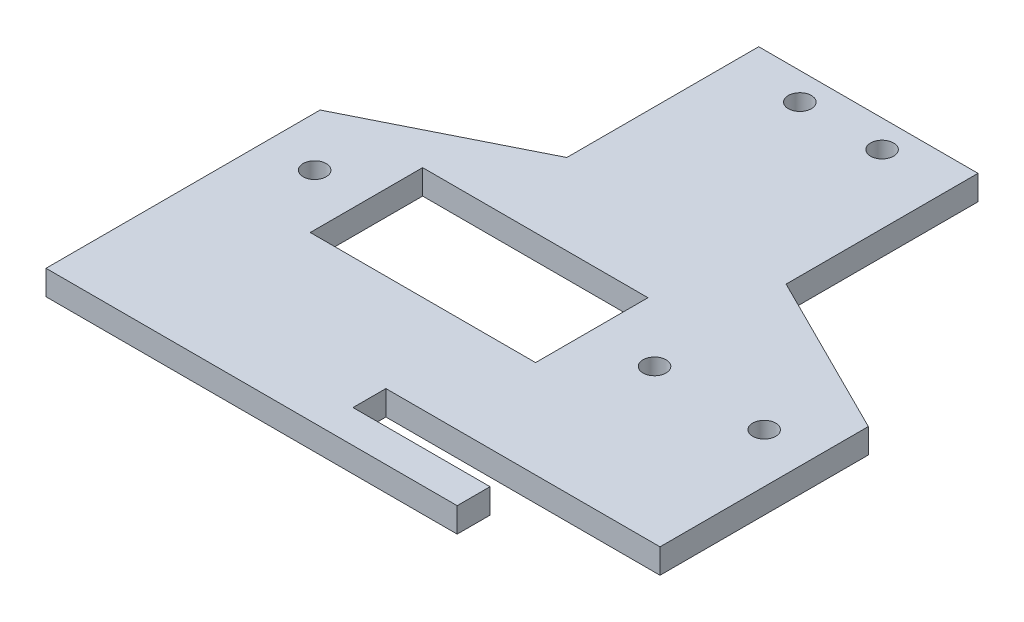
ISO-10303-21;
HEADER;
FILE_DESCRIPTION(('STEP AP214'),'2;1');
FILE_NAME('part.step','',(''),(''),'','','');
FILE_SCHEMA(('AUTOMOTIVE_DESIGN { 1 0 10303 214 1 1 1 1 }'));
ENDSEC;
DATA;
#1=APPLICATION_CONTEXT('core data for automotive mechanical design processes');
#2=APPLICATION_PROTOCOL_DEFINITION('international standard','automotive_design',2000,#1);
#3=PRODUCT_CONTEXT('',#1,'mechanical');
#4=PRODUCT('Part','Part','',(#3));
#5=PRODUCT_RELATED_PRODUCT_CATEGORY('part','',(#4));
#6=PRODUCT_DEFINITION_FORMATION('','',#4);
#7=PRODUCT_DEFINITION_CONTEXT('part definition',#1,'design');
#8=PRODUCT_DEFINITION('design','',#6,#7);
#9=PRODUCT_DEFINITION_SHAPE('','',#8);
#10=(LENGTH_UNIT() NAMED_UNIT(*) SI_UNIT(.MILLI.,.METRE.));
#11=(NAMED_UNIT(*) PLANE_ANGLE_UNIT() SI_UNIT($,.RADIAN.));
#12=(NAMED_UNIT(*) SI_UNIT($,.STERADIAN.) SOLID_ANGLE_UNIT());
#13=UNCERTAINTY_MEASURE_WITH_UNIT(LENGTH_MEASURE(1.E-05),#10,'distance_accuracy_value','');
#14=(GEOMETRIC_REPRESENTATION_CONTEXT(3) GLOBAL_UNCERTAINTY_ASSIGNED_CONTEXT((#13)) GLOBAL_UNIT_ASSIGNED_CONTEXT((#10,
#11,#12)) REPRESENTATION_CONTEXT('',''));
#15=CARTESIAN_POINT('',(0.,0.,0.));
#16=DIRECTION('',(0.,0.,1.));
#17=DIRECTION('',(1.,0.,0.));
#18=AXIS2_PLACEMENT_3D('',#15,#16,#17);
#19=CARTESIAN_POINT('',(0.,4.5,0.));
#20=DIRECTION('',(0.,1.,0.));
#21=DIRECTION('',(0.,0.,1.));
#22=AXIS2_PLACEMENT_3D('',#19,#20,#21);
#23=PLANE('',#22);
#24=CARTESIAN_POINT('',(-7.5,4.5,-70.));
#25=DIRECTION('',(0.,1.,0.));
#26=DIRECTION('',(0.,0.,1.));
#27=AXIS2_PLACEMENT_3D('',#24,#25,#26);
#28=CIRCLE('',#27,2.1);
#29=CARTESIAN_POINT('',(-7.5,4.5,-67.9));
#30=VERTEX_POINT('',#29);
#31=EDGE_CURVE('E293',#30,#30,#28,.T.);
#32=ORIENTED_EDGE('',*,*,#31,.F.);
#33=EDGE_LOOP('',(#32));
#34=FACE_BOUND('',#33,.T.);
#35=CARTESIAN_POINT('',(7.5,4.5,-70.));
#36=DIRECTION('',(0.,1.,0.));
#37=DIRECTION('',(0.,0.,1.));
#38=AXIS2_PLACEMENT_3D('',#35,#36,#37);
#39=CIRCLE('',#38,2.1);
#40=CARTESIAN_POINT('',(7.5,4.5,-67.9));
#41=VERTEX_POINT('',#40);
#42=EDGE_CURVE('E286',#41,#41,#39,.T.);
#43=ORIENTED_EDGE('',*,*,#42,.F.);
#44=EDGE_LOOP('',(#43));
#45=FACE_BOUND('',#44,.T.);
#46=DIRECTION('',(-1.,0.,0.));
#47=VECTOR('',#46,1.);
#48=CARTESIAN_POINT('',(0.,4.5,13.));
#49=LINE('',#48,#47);
#50=CARTESIAN_POINT('',(50.,4.5,13.));
#51=VERTEX_POINT('',#50);
#52=CARTESIAN_POINT('',(0.,4.5,13.));
#53=VERTEX_POINT('',#52);
#54=EDGE_CURVE('E184',#51,#53,#49,.T.);
#55=ORIENTED_EDGE('',*,*,#54,.F.);
#56=DIRECTION('',(0.,0.,-1.));
#57=VECTOR('',#56,1.);
#58=CARTESIAN_POINT('',(50.,4.5,-25.));
#59=LINE('',#58,#57);
#60=CARTESIAN_POINT('',(50.,4.5,-25.));
#61=VERTEX_POINT('',#60);
#62=EDGE_CURVE('E234',#51,#61,#59,.T.);
#63=ORIENTED_EDGE('',*,*,#62,.T.);
#64=DIRECTION('',(-0.894427190999916,0.,-0.447213595499958));
#65=VECTOR('',#64,1.);
#66=CARTESIAN_POINT('',(20.,4.5,-40.));
#67=LINE('',#66,#65);
#68=CARTESIAN_POINT('',(20.,4.5,-40.));
#69=VERTEX_POINT('',#68);
#70=EDGE_CURVE('E236',#61,#69,#67,.T.);
#71=ORIENTED_EDGE('',*,*,#70,.T.);
#72=DIRECTION('',(0.,0.,-1.));
#73=VECTOR('',#72,1.);
#74=CARTESIAN_POINT('',(20.,4.5,-75.));
#75=LINE('',#74,#73);
#76=CARTESIAN_POINT('',(20.,4.5,-75.));
#77=VERTEX_POINT('',#76);
#78=EDGE_CURVE('E239',#69,#77,#75,.T.);
#79=ORIENTED_EDGE('',*,*,#78,.T.);
#80=DIRECTION('',(-1.,0.,0.));
#81=VECTOR('',#80,1.);
#82=CARTESIAN_POINT('',(-20.,4.5,-75.));
#83=LINE('',#82,#81);
#84=CARTESIAN_POINT('',(-20.,4.5,-75.));
#85=VERTEX_POINT('',#84);
#86=EDGE_CURVE('E241',#77,#85,#83,.T.);
#87=ORIENTED_EDGE('',*,*,#86,.T.);
#88=DIRECTION('',(0.,0.,1.));
#89=VECTOR('',#88,1.);
#90=CARTESIAN_POINT('',(-20.,4.5,-40.));
#91=LINE('',#90,#89);
#92=CARTESIAN_POINT('',(-20.,4.5,-40.));
#93=VERTEX_POINT('',#92);
#94=EDGE_CURVE('E243',#85,#93,#91,.T.);
#95=ORIENTED_EDGE('',*,*,#94,.T.);
#96=DIRECTION('',(-0.894427190999916,0.,0.447213595499958));
#97=VECTOR('',#96,1.);
#98=CARTESIAN_POINT('',(-20.,4.5,-40.));
#99=LINE('',#98,#97);
#100=CARTESIAN_POINT('',(-50.,4.5,-25.));
#101=VERTEX_POINT('',#100);
#102=EDGE_CURVE('E245',#93,#101,#99,.T.);
#103=ORIENTED_EDGE('',*,*,#102,.T.);
#104=DIRECTION('',(0.,0.,1.));
#105=VECTOR('',#104,1.);
#106=CARTESIAN_POINT('',(-50.,4.5,-25.));
#107=LINE('',#106,#105);
#108=CARTESIAN_POINT('',(-50.,4.5,25.));
#109=VERTEX_POINT('',#108);
#110=EDGE_CURVE('E247',#101,#109,#107,.T.);
#111=ORIENTED_EDGE('',*,*,#110,.T.);
#112=DIRECTION('',(1.,0.,0.));
#113=VECTOR('',#112,1.);
#114=CARTESIAN_POINT('',(-50.,4.5,25.));
#115=LINE('',#114,#113);
#116=CARTESIAN_POINT('',(25.,4.5,25.));
#117=VERTEX_POINT('',#116);
#118=EDGE_CURVE('E249',#109,#117,#115,.T.);
#119=ORIENTED_EDGE('',*,*,#118,.T.);
#120=DIRECTION('',(0.,0.,1.));
#121=VECTOR('',#120,1.);
#122=CARTESIAN_POINT('',(25.,4.5,0.));
#123=LINE('',#122,#121);
#124=CARTESIAN_POINT('',(25.,4.5,19.));
#125=VERTEX_POINT('',#124);
#126=EDGE_CURVE('E49',#125,#117,#123,.T.);
#127=ORIENTED_EDGE('',*,*,#126,.F.);
#128=DIRECTION('',(1.,0.,0.));
#129=VECTOR('',#128,1.);
#130=CARTESIAN_POINT('',(0.,4.5,19.));
#131=LINE('',#130,#129);
#132=CARTESIAN_POINT('',(0.,4.5,19.));
#133=VERTEX_POINT('',#132);
#134=EDGE_CURVE('E154',#133,#125,#131,.T.);
#135=ORIENTED_EDGE('',*,*,#134,.F.);
#136=DIRECTION('',(0.,0.,1.));
#137=VECTOR('',#136,1.);
#138=CARTESIAN_POINT('',(0.,4.5,0.));
#139=LINE('',#138,#137);
#140=EDGE_CURVE('E187',#53,#133,#139,.T.);
#141=ORIENTED_EDGE('',*,*,#140,.F.);
#142=EDGE_LOOP('',(#55,#63,#71,#79,#87,#95,#103,#111,#119,#127,#135,#141));
#143=FACE_BOUND('',#142,.T.);
#144=DIRECTION('',(0.,0.,1.));
#145=VECTOR('',#144,1.);
#146=CARTESIAN_POINT('',(-31.55,4.5,0.));
#147=LINE('',#146,#145);
#148=CARTESIAN_POINT('',(-31.55,4.5,-25.25));
#149=VERTEX_POINT('',#148);
#150=CARTESIAN_POINT('',(-31.55,4.5,-4.75000000000001));
#151=VERTEX_POINT('',#150);
#152=EDGE_CURVE('E213',#149,#151,#147,.T.);
#153=ORIENTED_EDGE('',*,*,#152,.F.);
#154=DIRECTION('',(-1.,0.,0.));
#155=VECTOR('',#154,1.);
#156=CARTESIAN_POINT('',(0.,4.5,-25.25));
#157=LINE('',#156,#155);
#158=CARTESIAN_POINT('',(9.55000000000006,4.5,-25.25));
#159=VERTEX_POINT('',#158);
#160=EDGE_CURVE('E202',#159,#149,#157,.T.);
#161=ORIENTED_EDGE('',*,*,#160,.F.);
#162=DIRECTION('',(0.,0.,-1.));
#163=VECTOR('',#162,1.);
#164=CARTESIAN_POINT('',(9.55000000000005,4.5,0.));
#165=LINE('',#164,#163);
#166=CARTESIAN_POINT('',(9.55000000000005,4.5,-4.75000000000001));
#167=VERTEX_POINT('',#166);
#168=EDGE_CURVE('E209',#167,#159,#165,.T.);
#169=ORIENTED_EDGE('',*,*,#168,.F.);
#170=DIRECTION('',(1.,0.,0.));
#171=VECTOR('',#170,1.);
#172=CARTESIAN_POINT('',(0.,4.5,-4.75000000000001));
#173=LINE('',#172,#171);
#174=EDGE_CURVE('E211',#151,#167,#173,.T.);
#175=ORIENTED_EDGE('',*,*,#174,.F.);
#176=EDGE_LOOP('',(#153,#161,#169,#175));
#177=FACE_BOUND('',#176,.T.);
#178=CARTESIAN_POINT('',(-41.,4.5,-15.));
#179=DIRECTION('',(0.,1.,0.));
#180=DIRECTION('',(0.,0.,1.));
#181=AXIS2_PLACEMENT_3D('',#178,#179,#180);
#182=CIRCLE('',#181,2.1);
#183=CARTESIAN_POINT('',(-41.,4.5,-12.9));
#184=VERTEX_POINT('',#183);
#185=EDGE_CURVE('E228',#184,#184,#182,.T.);
#186=ORIENTED_EDGE('',*,*,#185,.F.);
#187=EDGE_LOOP('',(#186));
#188=FACE_BOUND('',#187,.T.);
#189=CARTESIAN_POINT('',(41.,4.5,-15.));
#190=DIRECTION('',(0.,1.,0.));
#191=DIRECTION('',(0.,0.,1.));
#192=AXIS2_PLACEMENT_3D('',#189,#190,#191);
#193=CIRCLE('',#192,2.1);
#194=CARTESIAN_POINT('',(41.,4.5,-12.9));
#195=VERTEX_POINT('',#194);
#196=EDGE_CURVE('E222',#195,#195,#193,.T.);
#197=ORIENTED_EDGE('',*,*,#196,.F.);
#198=EDGE_LOOP('',(#197));
#199=FACE_BOUND('',#198,.T.);
#200=CARTESIAN_POINT('',(21.,4.5,-15.));
#201=DIRECTION('',(0.,1.,0.));
#202=DIRECTION('',(0.,0.,1.));
#203=AXIS2_PLACEMENT_3D('',#200,#201,#202);
#204=CIRCLE('',#203,2.1);
#205=CARTESIAN_POINT('',(21.,4.5,-12.9));
#206=VERTEX_POINT('',#205);
#207=EDGE_CURVE('E216',#206,#206,#204,.T.);
#208=ORIENTED_EDGE('',*,*,#207,.F.);
#209=EDGE_LOOP('',(#208));
#210=FACE_BOUND('',#209,.T.);
#211=ADVANCED_FACE('F32',(#34,#45,#143,#177,#188,#199,#210),#23,.T.);
#212=CARTESIAN_POINT('',(0.,0.,0.));
#213=DIRECTION('',(0.,1.,0.));
#214=DIRECTION('',(0.,0.,1.));
#215=AXIS2_PLACEMENT_3D('',#212,#213,#214);
#216=PLANE('',#215);
#217=CARTESIAN_POINT('',(-7.5,0.,-70.));
#218=DIRECTION('',(0.,1.,0.));
#219=DIRECTION('',(0.,0.,1.));
#220=AXIS2_PLACEMENT_3D('',#217,#218,#219);
#221=CIRCLE('',#220,2.1);
#222=CARTESIAN_POINT('',(-7.5,0.,-67.9));
#223=VERTEX_POINT('',#222);
#224=EDGE_CURVE('E36',#223,#223,#221,.T.);
#225=ORIENTED_EDGE('',*,*,#224,.T.);
#226=EDGE_LOOP('',(#225));
#227=FACE_BOUND('',#226,.T.);
#228=CARTESIAN_POINT('',(7.5,0.,-70.));
#229=DIRECTION('',(0.,1.,0.));
#230=DIRECTION('',(0.,0.,1.));
#231=AXIS2_PLACEMENT_3D('',#228,#229,#230);
#232=CIRCLE('',#231,2.1);
#233=CARTESIAN_POINT('',(7.5,0.,-67.9));
#234=VERTEX_POINT('',#233);
#235=EDGE_CURVE('E164',#234,#234,#232,.T.);
#236=ORIENTED_EDGE('',*,*,#235,.T.);
#237=EDGE_LOOP('',(#236));
#238=FACE_BOUND('',#237,.T.);
#239=DIRECTION('',(1.,0.,0.));
#240=VECTOR('',#239,1.);
#241=CARTESIAN_POINT('',(9.55000000000006,0.,-25.25));
#242=LINE('',#241,#240);
#243=CARTESIAN_POINT('',(-31.55,0.,-25.25));
#244=VERTEX_POINT('',#243);
#245=CARTESIAN_POINT('',(9.55000000000006,0.,-25.25));
#246=VERTEX_POINT('',#245);
#247=EDGE_CURVE('E191',#244,#246,#242,.T.);
#248=ORIENTED_EDGE('',*,*,#247,.F.);
#249=DIRECTION('',(0.,0.,-1.));
#250=VECTOR('',#249,1.);
#251=CARTESIAN_POINT('',(-31.55,0.,-25.25));
#252=LINE('',#251,#250);
#253=CARTESIAN_POINT('',(-31.55,0.,-4.75000000000001));
#254=VERTEX_POINT('',#253);
#255=EDGE_CURVE('E189',#254,#244,#252,.T.);
#256=ORIENTED_EDGE('',*,*,#255,.F.);
#257=DIRECTION('',(-1.,0.,0.));
#258=VECTOR('',#257,1.);
#259=CARTESIAN_POINT('',(-31.55,0.,-4.75000000000001));
#260=LINE('',#259,#258);
#261=CARTESIAN_POINT('',(9.55000000000005,0.,-4.75000000000001));
#262=VERTEX_POINT('',#261);
#263=EDGE_CURVE('E196',#262,#254,#260,.T.);
#264=ORIENTED_EDGE('',*,*,#263,.F.);
#265=DIRECTION('',(0.,0.,1.));
#266=VECTOR('',#265,1.);
#267=CARTESIAN_POINT('',(9.55000000000005,0.,-4.75000000000001));
#268=LINE('',#267,#266);
#269=EDGE_CURVE('E193',#246,#262,#268,.T.);
#270=ORIENTED_EDGE('',*,*,#269,.F.);
#271=EDGE_LOOP('',(#248,#256,#264,#270));
#272=FACE_BOUND('',#271,.T.);
#273=CARTESIAN_POINT('',(-41.,0.,-15.));
#274=DIRECTION('',(0.,1.,0.));
#275=DIRECTION('',(0.,0.,1.));
#276=AXIS2_PLACEMENT_3D('',#273,#274,#275);
#277=CIRCLE('',#276,2.1);
#278=CARTESIAN_POINT('',(-41.,0.,-12.9));
#279=VERTEX_POINT('',#278);
#280=EDGE_CURVE('E225',#279,#279,#277,.T.);
#281=ORIENTED_EDGE('',*,*,#280,.T.);
#282=EDGE_LOOP('',(#281));
#283=FACE_BOUND('',#282,.T.);
#284=DIRECTION('',(0.,0.,-1.));
#285=VECTOR('',#284,1.);
#286=CARTESIAN_POINT('',(50.,0.,-25.));
#287=LINE('',#286,#285);
#288=CARTESIAN_POINT('',(50.,0.,13.));
#289=VERTEX_POINT('',#288);
#290=CARTESIAN_POINT('',(50.,0.,-25.));
#291=VERTEX_POINT('',#290);
#292=EDGE_CURVE('E231',#289,#291,#287,.T.);
#293=ORIENTED_EDGE('',*,*,#292,.F.);
#294=DIRECTION('',(1.,0.,0.));
#295=VECTOR('',#294,1.);
#296=CARTESIAN_POINT('',(50.,0.,13.));
#297=LINE('',#296,#295);
#298=CARTESIAN_POINT('',(0.,0.,13.));
#299=VERTEX_POINT('',#298);
#300=EDGE_CURVE('E156',#299,#289,#297,.T.);
#301=ORIENTED_EDGE('',*,*,#300,.F.);
#302=DIRECTION('',(0.,0.,-1.));
#303=VECTOR('',#302,1.);
#304=CARTESIAN_POINT('',(0.,0.,19.));
#305=LINE('',#304,#303);
#306=CARTESIAN_POINT('',(0.,0.,19.));
#307=VERTEX_POINT('',#306);
#308=EDGE_CURVE('E171',#307,#299,#305,.T.);
#309=ORIENTED_EDGE('',*,*,#308,.F.);
#310=DIRECTION('',(-1.,0.,0.));
#311=VECTOR('',#310,1.);
#312=CARTESIAN_POINT('',(0.,0.,19.));
#313=LINE('',#312,#311);
#314=CARTESIAN_POINT('',(25.,0.,19.));
#315=VERTEX_POINT('',#314);
#316=EDGE_CURVE('E151',#315,#307,#313,.T.);
#317=ORIENTED_EDGE('',*,*,#316,.F.);
#318=DIRECTION('',(0.,0.,-1.));
#319=VECTOR('',#318,1.);
#320=CARTESIAN_POINT('',(25.,0.,19.));
#321=LINE('',#320,#319);
#322=CARTESIAN_POINT('',(25.,0.,25.));
#323=VERTEX_POINT('',#322);
#324=EDGE_CURVE('E159',#323,#315,#321,.T.);
#325=ORIENTED_EDGE('',*,*,#324,.F.);
#326=DIRECTION('',(1.,0.,0.));
#327=VECTOR('',#326,1.);
#328=CARTESIAN_POINT('',(-50.,0.,25.));
#329=LINE('',#328,#327);
#330=CARTESIAN_POINT('',(-50.,0.,25.));
#331=VERTEX_POINT('',#330);
#332=EDGE_CURVE('E237',#331,#323,#329,.T.);
#333=ORIENTED_EDGE('',*,*,#332,.F.);
#334=DIRECTION('',(0.,0.,1.));
#335=VECTOR('',#334,1.);
#336=CARTESIAN_POINT('',(-50.,0.,-25.));
#337=LINE('',#336,#335);
#338=CARTESIAN_POINT('',(-50.,0.,-25.));
#339=VERTEX_POINT('',#338);
#340=EDGE_CURVE('E264',#339,#331,#337,.T.);
#341=ORIENTED_EDGE('',*,*,#340,.F.);
#342=DIRECTION('',(-0.894427190999916,0.,0.447213595499958));
#343=VECTOR('',#342,1.);
#344=CARTESIAN_POINT('',(-20.,0.,-40.));
#345=LINE('',#344,#343);
#346=CARTESIAN_POINT('',(-20.,0.,-40.));
#347=VERTEX_POINT('',#346);
#348=EDGE_CURVE('E262',#347,#339,#345,.T.);
#349=ORIENTED_EDGE('',*,*,#348,.F.);
#350=DIRECTION('',(0.,0.,1.));
#351=VECTOR('',#350,1.);
#352=CARTESIAN_POINT('',(-20.,0.,-40.));
#353=LINE('',#352,#351);
#354=CARTESIAN_POINT('',(-20.,0.,-75.));
#355=VERTEX_POINT('',#354);
#356=EDGE_CURVE('E260',#355,#347,#353,.T.);
#357=ORIENTED_EDGE('',*,*,#356,.F.);
#358=DIRECTION('',(-1.,0.,0.));
#359=VECTOR('',#358,1.);
#360=CARTESIAN_POINT('',(-20.,0.,-75.));
#361=LINE('',#360,#359);
#362=CARTESIAN_POINT('',(20.,0.,-75.));
#363=VERTEX_POINT('',#362);
#364=EDGE_CURVE('E258',#363,#355,#361,.T.);
#365=ORIENTED_EDGE('',*,*,#364,.F.);
#366=DIRECTION('',(0.,0.,-1.));
#367=VECTOR('',#366,1.);
#368=CARTESIAN_POINT('',(20.,0.,-75.));
#369=LINE('',#368,#367);
#370=CARTESIAN_POINT('',(20.,0.,-40.));
#371=VERTEX_POINT('',#370);
#372=EDGE_CURVE('E256',#371,#363,#369,.T.);
#373=ORIENTED_EDGE('',*,*,#372,.F.);
#374=DIRECTION('',(-0.894427190999916,0.,-0.447213595499958));
#375=VECTOR('',#374,1.);
#376=CARTESIAN_POINT('',(20.,0.,-40.));
#377=LINE('',#376,#375);
#378=EDGE_CURVE('E254',#291,#371,#377,.T.);
#379=ORIENTED_EDGE('',*,*,#378,.F.);
#380=EDGE_LOOP('',(#293,#301,#309,#317,#325,#333,#341,#349,#357,#365,#373,#379));
#381=FACE_BOUND('',#380,.T.);
#382=CARTESIAN_POINT('',(41.,0.,-15.));
#383=DIRECTION('',(0.,1.,0.));
#384=DIRECTION('',(0.,0.,1.));
#385=AXIS2_PLACEMENT_3D('',#382,#383,#384);
#386=CIRCLE('',#385,2.1);
#387=CARTESIAN_POINT('',(41.,0.,-12.9));
#388=VERTEX_POINT('',#387);
#389=EDGE_CURVE('E219',#388,#388,#386,.T.);
#390=ORIENTED_EDGE('',*,*,#389,.T.);
#391=EDGE_LOOP('',(#390));
#392=FACE_BOUND('',#391,.T.);
#393=CARTESIAN_POINT('',(21.,0.,-15.));
#394=DIRECTION('',(0.,1.,0.));
#395=DIRECTION('',(0.,0.,1.));
#396=AXIS2_PLACEMENT_3D('',#393,#394,#395);
#397=CIRCLE('',#396,2.1);
#398=CARTESIAN_POINT('',(21.,0.,-12.9));
#399=VERTEX_POINT('',#398);
#400=EDGE_CURVE('E215',#399,#399,#397,.T.);
#401=ORIENTED_EDGE('',*,*,#400,.T.);
#402=EDGE_LOOP('',(#401));
#403=FACE_BOUND('',#402,.T.);
#404=ADVANCED_FACE('F167',(#227,#238,#272,#283,#381,#392,#403),#216,.F.);
#405=CARTESIAN_POINT('',(50.,4.5,-25.));
#406=DIRECTION('',(-1.,0.,0.));
#407=DIRECTION('',(0.,0.,1.));
#408=AXIS2_PLACEMENT_3D('',#405,#406,#407);
#409=PLANE('',#408);
#410=ORIENTED_EDGE('',*,*,#62,.F.);
#411=DIRECTION('',(0.,-1.,0.));
#412=VECTOR('',#411,1.);
#413=CARTESIAN_POINT('',(50.,10.,13.));
#414=LINE('',#413,#412);
#415=EDGE_CURVE('E177',#51,#289,#414,.T.);
#416=ORIENTED_EDGE('',*,*,#415,.T.);
#417=ORIENTED_EDGE('',*,*,#292,.T.);
#418=DIRECTION('',(0.,-1.,0.));
#419=VECTOR('',#418,1.);
#420=CARTESIAN_POINT('',(50.,4.5,-25.));
#421=LINE('',#420,#419);
#422=EDGE_CURVE('E41',#61,#291,#421,.T.);
#423=ORIENTED_EDGE('',*,*,#422,.F.);
#424=EDGE_LOOP('',(#410,#416,#417,#423));
#425=FACE_BOUND('',#424,.T.);
#426=ADVANCED_FACE('F34',(#425),#409,.F.);
#427=CARTESIAN_POINT('',(20.,4.5,-40.));
#428=DIRECTION('',(-0.447213595499958,0.,0.894427190999916));
#429=DIRECTION('',(0.894427190999916,0.,0.447213595499958));
#430=AXIS2_PLACEMENT_3D('',#427,#428,#429);
#431=PLANE('',#430);
#432=ORIENTED_EDGE('',*,*,#378,.T.);
#433=DIRECTION('',(0.,-1.,0.));
#434=VECTOR('',#433,1.);
#435=CARTESIAN_POINT('',(20.,4.5,-40.));
#436=LINE('',#435,#434);
#437=EDGE_CURVE('E281',#69,#371,#436,.T.);
#438=ORIENTED_EDGE('',*,*,#437,.F.);
#439=ORIENTED_EDGE('',*,*,#70,.F.);
#440=ORIENTED_EDGE('',*,*,#422,.T.);
#441=EDGE_LOOP('',(#432,#438,#439,#440));
#442=FACE_BOUND('',#441,.T.);
#443=ADVANCED_FACE('F333',(#442),#431,.F.);
#444=CARTESIAN_POINT('',(20.,4.5,-75.));
#445=DIRECTION('',(-1.,0.,0.));
#446=DIRECTION('',(0.,0.,1.));
#447=AXIS2_PLACEMENT_3D('',#444,#445,#446);
#448=PLANE('',#447);
#449=ORIENTED_EDGE('',*,*,#372,.T.);
#450=DIRECTION('',(0.,-1.,0.));
#451=VECTOR('',#450,1.);
#452=CARTESIAN_POINT('',(20.,4.5,-75.));
#453=LINE('',#452,#451);
#454=EDGE_CURVE('E278',#77,#363,#453,.T.);
#455=ORIENTED_EDGE('',*,*,#454,.F.);
#456=ORIENTED_EDGE('',*,*,#78,.F.);
#457=ORIENTED_EDGE('',*,*,#437,.T.);
#458=EDGE_LOOP('',(#449,#455,#456,#457));
#459=FACE_BOUND('',#458,.T.);
#460=ADVANCED_FACE('F357',(#459),#448,.F.);
#461=CARTESIAN_POINT('',(-20.,4.5,-75.));
#462=DIRECTION('',(0.,0.,1.));
#463=DIRECTION('',(1.,0.,0.));
#464=AXIS2_PLACEMENT_3D('',#461,#462,#463);
#465=PLANE('',#464);
#466=ORIENTED_EDGE('',*,*,#364,.T.);
#467=DIRECTION('',(0.,-1.,0.));
#468=VECTOR('',#467,1.);
#469=CARTESIAN_POINT('',(-20.,4.5,-75.));
#470=LINE('',#469,#468);
#471=EDGE_CURVE('E275',#85,#355,#470,.T.);
#472=ORIENTED_EDGE('',*,*,#471,.F.);
#473=ORIENTED_EDGE('',*,*,#86,.F.);
#474=ORIENTED_EDGE('',*,*,#454,.T.);
#475=EDGE_LOOP('',(#466,#472,#473,#474));
#476=FACE_BOUND('',#475,.T.);
#477=ADVANCED_FACE('F353',(#476),#465,.F.);
#478=CARTESIAN_POINT('',(-20.,4.5,-40.));
#479=DIRECTION('',(1.,0.,0.));
#480=DIRECTION('',(0.,0.,-1.));
#481=AXIS2_PLACEMENT_3D('',#478,#479,#480);
#482=PLANE('',#481);
#483=ORIENTED_EDGE('',*,*,#356,.T.);
#484=DIRECTION('',(0.,-1.,0.));
#485=VECTOR('',#484,1.);
#486=CARTESIAN_POINT('',(-20.,4.5,-40.));
#487=LINE('',#486,#485);
#488=EDGE_CURVE('E272',#93,#347,#487,.T.);
#489=ORIENTED_EDGE('',*,*,#488,.F.);
#490=ORIENTED_EDGE('',*,*,#94,.F.);
#491=ORIENTED_EDGE('',*,*,#471,.T.);
#492=EDGE_LOOP('',(#483,#489,#490,#491));
#493=FACE_BOUND('',#492,.T.);
#494=ADVANCED_FACE('F349',(#493),#482,.F.);
#495=CARTESIAN_POINT('',(-20.,4.5,-40.));
#496=DIRECTION('',(0.447213595499958,0.,0.894427190999916));
#497=DIRECTION('',(0.894427190999916,0.,-0.447213595499958));
#498=AXIS2_PLACEMENT_3D('',#495,#496,#497);
#499=PLANE('',#498);
#500=ORIENTED_EDGE('',*,*,#348,.T.);
#501=DIRECTION('',(0.,-1.,0.));
#502=VECTOR('',#501,1.);
#503=CARTESIAN_POINT('',(-50.,4.5,-25.));
#504=LINE('',#503,#502);
#505=EDGE_CURVE('E269',#101,#339,#504,.T.);
#506=ORIENTED_EDGE('',*,*,#505,.F.);
#507=ORIENTED_EDGE('',*,*,#102,.F.);
#508=ORIENTED_EDGE('',*,*,#488,.T.);
#509=EDGE_LOOP('',(#500,#506,#507,#508));
#510=FACE_BOUND('',#509,.T.);
#511=ADVANCED_FACE('F345',(#510),#499,.F.);
#512=CARTESIAN_POINT('',(-50.,4.5,-25.));
#513=DIRECTION('',(1.,0.,0.));
#514=DIRECTION('',(0.,0.,-1.));
#515=AXIS2_PLACEMENT_3D('',#512,#513,#514);
#516=PLANE('',#515);
#517=ORIENTED_EDGE('',*,*,#340,.T.);
#518=DIRECTION('',(0.,-1.,0.));
#519=VECTOR('',#518,1.);
#520=CARTESIAN_POINT('',(-50.,4.5,25.));
#521=LINE('',#520,#519);
#522=EDGE_CURVE('E252',#109,#331,#521,.T.);
#523=ORIENTED_EDGE('',*,*,#522,.F.);
#524=ORIENTED_EDGE('',*,*,#110,.F.);
#525=ORIENTED_EDGE('',*,*,#505,.T.);
#526=EDGE_LOOP('',(#517,#523,#524,#525));
#527=FACE_BOUND('',#526,.T.);
#528=ADVANCED_FACE('F341',(#527),#516,.F.);
#529=CARTESIAN_POINT('',(-50.,4.5,25.));
#530=DIRECTION('',(0.,0.,-1.));
#531=DIRECTION('',(-1.,0.,0.));
#532=AXIS2_PLACEMENT_3D('',#529,#530,#531);
#533=PLANE('',#532);
#534=ORIENTED_EDGE('',*,*,#332,.T.);
#535=DIRECTION('',(0.,1.,0.));
#536=VECTOR('',#535,1.);
#537=CARTESIAN_POINT('',(25.,4.5,25.));
#538=LINE('',#537,#536);
#539=EDGE_CURVE('E11',#323,#117,#538,.T.);
#540=ORIENTED_EDGE('',*,*,#539,.T.);
#541=ORIENTED_EDGE('',*,*,#118,.F.);
#542=ORIENTED_EDGE('',*,*,#522,.T.);
#543=EDGE_LOOP('',(#534,#540,#541,#542));
#544=FACE_BOUND('',#543,.T.);
#545=ADVANCED_FACE('F337',(#544),#533,.F.);
#546=CARTESIAN_POINT('',(-41.,4.5,-15.));
#547=DIRECTION('',(0.,-1.,0.));
#548=DIRECTION('',(0.,0.,-1.));
#549=AXIS2_PLACEMENT_3D('',#546,#547,#548);
#550=CYLINDRICAL_SURFACE('',#549,2.1);
#551=ORIENTED_EDGE('',*,*,#185,.T.);
#552=EDGE_LOOP('',(#551));
#553=FACE_BOUND('',#552,.T.);
#554=ORIENTED_EDGE('',*,*,#280,.F.);
#555=EDGE_LOOP('',(#554));
#556=FACE_BOUND('',#555,.T.);
#557=ADVANCED_FACE('F340',(#553,#556),#550,.F.);
#558=CARTESIAN_POINT('',(41.,4.5,-15.));
#559=DIRECTION('',(0.,-1.,0.));
#560=DIRECTION('',(0.,0.,-1.));
#561=AXIS2_PLACEMENT_3D('',#558,#559,#560);
#562=CYLINDRICAL_SURFACE('',#561,2.1);
#563=ORIENTED_EDGE('',*,*,#196,.T.);
#564=EDGE_LOOP('',(#563));
#565=FACE_BOUND('',#564,.T.);
#566=ORIENTED_EDGE('',*,*,#389,.F.);
#567=EDGE_LOOP('',(#566));
#568=FACE_BOUND('',#567,.T.);
#569=ADVANCED_FACE('F323',(#565,#568),#562,.F.);
#570=CARTESIAN_POINT('',(21.,4.5,-15.));
#571=DIRECTION('',(0.,-1.,0.));
#572=DIRECTION('',(0.,0.,-1.));
#573=AXIS2_PLACEMENT_3D('',#570,#571,#572);
#574=CYLINDRICAL_SURFACE('',#573,2.1);
#575=ORIENTED_EDGE('',*,*,#207,.T.);
#576=EDGE_LOOP('',(#575));
#577=FACE_BOUND('',#576,.T.);
#578=ORIENTED_EDGE('',*,*,#400,.F.);
#579=EDGE_LOOP('',(#578));
#580=FACE_BOUND('',#579,.T.);
#581=ADVANCED_FACE('F319',(#577,#580),#574,.F.);
#582=CARTESIAN_POINT('',(-31.55,10.,-25.25));
#583=DIRECTION('',(-1.,0.,0.));
#584=DIRECTION('',(0.,0.,1.));
#585=AXIS2_PLACEMENT_3D('',#582,#583,#584);
#586=PLANE('',#585);
#587=ORIENTED_EDGE('',*,*,#152,.T.);
#588=DIRECTION('',(0.,-1.,0.));
#589=VECTOR('',#588,1.);
#590=CARTESIAN_POINT('',(-31.55,10.,-4.75000000000001));
#591=LINE('',#590,#589);
#592=EDGE_CURVE('E200',#151,#254,#591,.T.);
#593=ORIENTED_EDGE('',*,*,#592,.T.);
#594=ORIENTED_EDGE('',*,*,#255,.T.);
#595=DIRECTION('',(0.,-1.,0.));
#596=VECTOR('',#595,1.);
#597=CARTESIAN_POINT('',(-31.55,10.,-25.25));
#598=LINE('',#597,#596);
#599=EDGE_CURVE('E199',#149,#244,#598,.T.);
#600=ORIENTED_EDGE('',*,*,#599,.F.);
#601=EDGE_LOOP('',(#587,#593,#594,#600));
#602=FACE_BOUND('',#601,.T.);
#603=ADVANCED_FACE('F322',(#602),#586,.F.);
#604=CARTESIAN_POINT('',(-31.55,10.,-4.75000000000001));
#605=DIRECTION('',(0.,0.,1.));
#606=DIRECTION('',(1.,0.,0.));
#607=AXIS2_PLACEMENT_3D('',#604,#605,#606);
#608=PLANE('',#607);
#609=ORIENTED_EDGE('',*,*,#174,.T.);
#610=DIRECTION('',(0.,-1.,0.));
#611=VECTOR('',#610,1.);
#612=CARTESIAN_POINT('',(9.55000000000005,10.,-4.75000000000001));
#613=LINE('',#612,#611);
#614=EDGE_CURVE('E203',#167,#262,#613,.T.);
#615=ORIENTED_EDGE('',*,*,#614,.T.);
#616=ORIENTED_EDGE('',*,*,#263,.T.);
#617=ORIENTED_EDGE('',*,*,#592,.F.);
#618=EDGE_LOOP('',(#609,#615,#616,#617));
#619=FACE_BOUND('',#618,.T.);
#620=ADVANCED_FACE('F404',(#619),#608,.F.);
#621=CARTESIAN_POINT('',(9.55000000000005,10.,-4.75000000000001));
#622=DIRECTION('',(1.,0.,0.));
#623=DIRECTION('',(0.,0.,-1.));
#624=AXIS2_PLACEMENT_3D('',#621,#622,#623);
#625=PLANE('',#624);
#626=ORIENTED_EDGE('',*,*,#168,.T.);
#627=DIRECTION('',(0.,-1.,0.));
#628=VECTOR('',#627,1.);
#629=CARTESIAN_POINT('',(9.55000000000006,10.,-25.25));
#630=LINE('',#629,#628);
#631=EDGE_CURVE('E56',#159,#246,#630,.T.);
#632=ORIENTED_EDGE('',*,*,#631,.T.);
#633=ORIENTED_EDGE('',*,*,#269,.T.);
#634=ORIENTED_EDGE('',*,*,#614,.F.);
#635=EDGE_LOOP('',(#626,#632,#633,#634));
#636=FACE_BOUND('',#635,.T.);
#637=ADVANCED_FACE('F407',(#636),#625,.F.);
#638=CARTESIAN_POINT('',(9.55000000000006,10.,-25.25));
#639=DIRECTION('',(0.,0.,-1.));
#640=DIRECTION('',(-1.,0.,0.));
#641=AXIS2_PLACEMENT_3D('',#638,#639,#640);
#642=PLANE('',#641);
#643=ORIENTED_EDGE('',*,*,#160,.T.);
#644=ORIENTED_EDGE('',*,*,#599,.T.);
#645=ORIENTED_EDGE('',*,*,#247,.T.);
#646=ORIENTED_EDGE('',*,*,#631,.F.);
#647=EDGE_LOOP('',(#643,#644,#645,#646));
#648=FACE_BOUND('',#647,.T.);
#649=ADVANCED_FACE('F397',(#648),#642,.F.);
#650=CARTESIAN_POINT('',(50.,10.,13.));
#651=DIRECTION('',(0.,0.,-1.));
#652=DIRECTION('',(-1.,0.,0.));
#653=AXIS2_PLACEMENT_3D('',#650,#651,#652);
#654=PLANE('',#653);
#655=ORIENTED_EDGE('',*,*,#54,.T.);
#656=DIRECTION('',(0.,-1.,0.));
#657=VECTOR('',#656,1.);
#658=CARTESIAN_POINT('',(0.,10.,13.));
#659=LINE('',#658,#657);
#660=EDGE_CURVE('E180',#53,#299,#659,.T.);
#661=ORIENTED_EDGE('',*,*,#660,.T.);
#662=ORIENTED_EDGE('',*,*,#300,.T.);
#663=ORIENTED_EDGE('',*,*,#415,.F.);
#664=EDGE_LOOP('',(#655,#661,#662,#663));
#665=FACE_BOUND('',#664,.T.);
#666=ADVANCED_FACE('F382',(#665),#654,.F.);
#667=CARTESIAN_POINT('',(0.,10.,19.));
#668=DIRECTION('',(-1.,0.,0.));
#669=DIRECTION('',(0.,0.,1.));
#670=AXIS2_PLACEMENT_3D('',#667,#668,#669);
#671=PLANE('',#670);
#672=ORIENTED_EDGE('',*,*,#140,.T.);
#673=DIRECTION('',(0.,-1.,0.));
#674=VECTOR('',#673,1.);
#675=CARTESIAN_POINT('',(0.,10.,19.));
#676=LINE('',#675,#674);
#677=EDGE_CURVE('E155',#133,#307,#676,.T.);
#678=ORIENTED_EDGE('',*,*,#677,.T.);
#679=ORIENTED_EDGE('',*,*,#308,.T.);
#680=ORIENTED_EDGE('',*,*,#660,.F.);
#681=EDGE_LOOP('',(#672,#678,#679,#680));
#682=FACE_BOUND('',#681,.T.);
#683=ADVANCED_FACE('F385',(#682),#671,.F.);
#684=CARTESIAN_POINT('',(0.,10.,19.));
#685=DIRECTION('',(0.,0.,1.));
#686=DIRECTION('',(1.,0.,0.));
#687=AXIS2_PLACEMENT_3D('',#684,#685,#686);
#688=PLANE('',#687);
#689=ORIENTED_EDGE('',*,*,#134,.T.);
#690=DIRECTION('',(0.,-1.,0.));
#691=VECTOR('',#690,1.);
#692=CARTESIAN_POINT('',(25.,10.,19.));
#693=LINE('',#692,#691);
#694=EDGE_CURVE('E146',#125,#315,#693,.T.);
#695=ORIENTED_EDGE('',*,*,#694,.T.);
#696=ORIENTED_EDGE('',*,*,#316,.T.);
#697=ORIENTED_EDGE('',*,*,#677,.F.);
#698=EDGE_LOOP('',(#689,#695,#696,#697));
#699=FACE_BOUND('',#698,.T.);
#700=ADVANCED_FACE('F148',(#699),#688,.F.);
#701=CARTESIAN_POINT('',(25.,10.,19.));
#702=DIRECTION('',(-1.,0.,0.));
#703=DIRECTION('',(0.,0.,1.));
#704=AXIS2_PLACEMENT_3D('',#701,#702,#703);
#705=PLANE('',#704);
#706=ORIENTED_EDGE('',*,*,#126,.T.);
#707=ORIENTED_EDGE('',*,*,#539,.F.);
#708=ORIENTED_EDGE('',*,*,#324,.T.);
#709=ORIENTED_EDGE('',*,*,#694,.F.);
#710=EDGE_LOOP('',(#706,#707,#708,#709));
#711=FACE_BOUND('',#710,.T.);
#712=ADVANCED_FACE('F160',(#711),#705,.F.);
#713=CARTESIAN_POINT('',(7.5,-5.5,-70.));
#714=DIRECTION('',(0.,1.,0.));
#715=DIRECTION('',(0.,0.,1.));
#716=AXIS2_PLACEMENT_3D('',#713,#714,#715);
#717=CYLINDRICAL_SURFACE('',#716,2.1);
#718=ORIENTED_EDGE('',*,*,#42,.T.);
#719=EDGE_LOOP('',(#718));
#720=FACE_BOUND('',#719,.T.);
#721=ORIENTED_EDGE('',*,*,#235,.F.);
#722=EDGE_LOOP('',(#721));
#723=FACE_BOUND('',#722,.T.);
#724=ADVANCED_FACE('F403',(#720,#723),#717,.F.);
#725=CARTESIAN_POINT('',(-7.5,-5.5,-70.));
#726=DIRECTION('',(0.,1.,0.));
#727=DIRECTION('',(0.,0.,1.));
#728=AXIS2_PLACEMENT_3D('',#725,#726,#727);
#729=CYLINDRICAL_SURFACE('',#728,2.1);
#730=ORIENTED_EDGE('',*,*,#31,.T.);
#731=EDGE_LOOP('',(#730));
#732=FACE_BOUND('',#731,.T.);
#733=ORIENTED_EDGE('',*,*,#224,.F.);
#734=EDGE_LOOP('',(#733));
#735=FACE_BOUND('',#734,.T.);
#736=ADVANCED_FACE('F298',(#732,#735),#729,.F.);
#737=CLOSED_SHELL('',(#211,#404,#426,#443,#460,#477,#494,#511,#528,#545,#557,#569,#581,#603,
#620,#637,#649,#666,#683,#700,#712,#724,#736));
#738=MANIFOLD_SOLID_BREP('B2',#737);
#739=ADVANCED_BREP_SHAPE_REPRESENTATION('',(#18,#738),#14);
#740=SHAPE_DEFINITION_REPRESENTATION(#9,#739);
ENDSEC;
END-ISO-10303-21;
